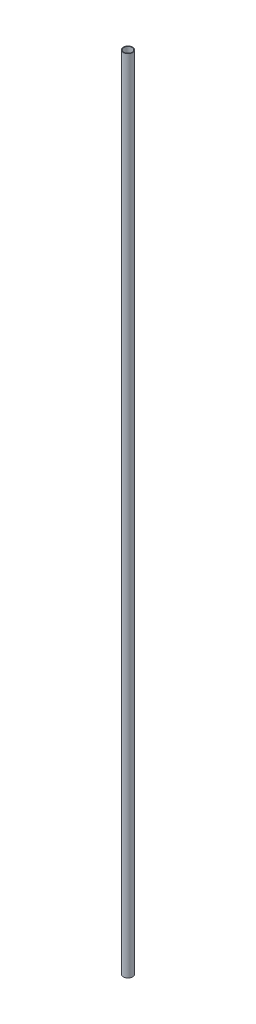
ISO-10303-21;
HEADER;
FILE_DESCRIPTION(('STEP AP214'),'2;1');
FILE_NAME('part.step','',(''),(''),'','','');
FILE_SCHEMA(('AUTOMOTIVE_DESIGN { 1 0 10303 214 1 1 1 1 }'));
ENDSEC;
DATA;
#1=APPLICATION_CONTEXT('core data for automotive mechanical design processes');
#2=APPLICATION_PROTOCOL_DEFINITION('international standard','automotive_design',2000,#1);
#3=PRODUCT_CONTEXT('',#1,'mechanical');
#4=PRODUCT('Part','Part','',(#3));
#5=PRODUCT_RELATED_PRODUCT_CATEGORY('part','',(#4));
#6=PRODUCT_DEFINITION_FORMATION('','',#4);
#7=PRODUCT_DEFINITION_CONTEXT('part definition',#1,'design');
#8=PRODUCT_DEFINITION('design','',#6,#7);
#9=PRODUCT_DEFINITION_SHAPE('','',#8);
#10=(LENGTH_UNIT() NAMED_UNIT(*) SI_UNIT(.MILLI.,.METRE.));
#11=(NAMED_UNIT(*) PLANE_ANGLE_UNIT() SI_UNIT($,.RADIAN.));
#12=(NAMED_UNIT(*) SI_UNIT($,.STERADIAN.) SOLID_ANGLE_UNIT());
#13=UNCERTAINTY_MEASURE_WITH_UNIT(LENGTH_MEASURE(1.E-05),#10,'distance_accuracy_value','');
#14=(GEOMETRIC_REPRESENTATION_CONTEXT(3) GLOBAL_UNCERTAINTY_ASSIGNED_CONTEXT((#13)) GLOBAL_UNIT_ASSIGNED_CONTEXT((#10,
#11,#12)) REPRESENTATION_CONTEXT('',''));
#15=CARTESIAN_POINT('',(0.,0.,0.));
#16=DIRECTION('',(0.,0.,1.));
#17=DIRECTION('',(1.,0.,0.));
#18=AXIS2_PLACEMENT_3D('',#15,#16,#17);
#19=CARTESIAN_POINT('',(0.,125.,0.));
#20=DIRECTION('',(0.,1.,0.));
#21=DIRECTION('',(0.,0.,1.));
#22=AXIS2_PLACEMENT_3D('',#19,#20,#21);
#23=PLANE('',#22);
#24=CARTESIAN_POINT('',(0.,125.,0.));
#25=DIRECTION('',(0.,1.,0.));
#26=DIRECTION('',(0.,0.,1.));
#27=AXIS2_PLACEMENT_3D('',#24,#25,#26);
#28=CIRCLE('',#27,0.73533);
#29=CARTESIAN_POINT('',(0.,125.,0.73533));
#30=VERTEX_POINT('',#29);
#31=EDGE_CURVE('E90',#30,#30,#28,.T.);
#32=ORIENTED_EDGE('',*,*,#31,.T.);
#33=EDGE_LOOP('',(#32));
#34=FACE_BOUND('',#33,.T.);
#35=CARTESIAN_POINT('',(0.,125.,0.));
#36=DIRECTION('',(0.,1.,0.));
#37=DIRECTION('',(0.,0.,1.));
#38=AXIS2_PLACEMENT_3D('',#35,#36,#37);
#39=CIRCLE('',#38,0.64516);
#40=CARTESIAN_POINT('',(0.,125.,0.64516));
#41=VERTEX_POINT('',#40);
#42=EDGE_CURVE('E91',#41,#41,#39,.T.);
#43=ORIENTED_EDGE('',*,*,#42,.F.);
#44=EDGE_LOOP('',(#43));
#45=FACE_BOUND('',#44,.T.);
#46=ADVANCED_FACE('F32',(#34,#45),#23,.T.);
#47=CARTESIAN_POINT('',(0.,0.,0.));
#48=DIRECTION('',(0.,1.,0.));
#49=DIRECTION('',(0.,0.,1.));
#50=AXIS2_PLACEMENT_3D('',#47,#48,#49);
#51=PLANE('',#50);
#52=CARTESIAN_POINT('',(0.,0.,0.));
#53=DIRECTION('',(0.,1.,0.));
#54=DIRECTION('',(0.,0.,1.));
#55=AXIS2_PLACEMENT_3D('',#52,#53,#54);
#56=CIRCLE('',#55,0.64516);
#57=CARTESIAN_POINT('',(-0.5,0.,-0.407714882730567));
#58=VERTEX_POINT('',#57);
#59=CARTESIAN_POINT('',(0.5,0.,-0.407714882730567));
#60=VERTEX_POINT('',#59);
#61=EDGE_CURVE('E77',#58,#60,#56,.T.);
#62=ORIENTED_EDGE('',*,*,#61,.T.);
#63=DIRECTION('',(0.,0.,1.));
#64=VECTOR('',#63,1.);
#65=CARTESIAN_POINT('',(0.5,0.,-0.73533));
#66=LINE('',#65,#64);
#67=CARTESIAN_POINT('',(0.5,0.,-0.539175489891742));
#68=VERTEX_POINT('',#67);
#69=EDGE_CURVE('E74',#68,#60,#66,.T.);
#70=ORIENTED_EDGE('',*,*,#69,.F.);
#71=CARTESIAN_POINT('',(0.,0.,0.));
#72=DIRECTION('',(0.,1.,0.));
#73=DIRECTION('',(0.,0.,1.));
#74=AXIS2_PLACEMENT_3D('',#71,#72,#73);
#75=CIRCLE('',#74,0.73533);
#76=CARTESIAN_POINT('',(-0.5,0.,-0.539175489891742));
#77=VERTEX_POINT('',#76);
#78=EDGE_CURVE('E85',#77,#68,#75,.T.);
#79=ORIENTED_EDGE('',*,*,#78,.F.);
#80=DIRECTION('',(0.,0.,-1.));
#81=VECTOR('',#80,1.);
#82=CARTESIAN_POINT('',(-0.5,0.,-0.73533));
#83=LINE('',#82,#81);
#84=EDGE_CURVE('E87',#58,#77,#83,.T.);
#85=ORIENTED_EDGE('',*,*,#84,.F.);
#86=EDGE_LOOP('',(#62,#70,#79,#85));
#87=FACE_BOUND('',#86,.T.);
#88=ADVANCED_FACE('F83',(#87),#51,.F.);
#89=CARTESIAN_POINT('',(0.,125.,0.));
#90=DIRECTION('',(0.,-1.,0.));
#91=DIRECTION('',(0.,0.,-1.));
#92=AXIS2_PLACEMENT_3D('',#89,#90,#91);
#93=CYLINDRICAL_SURFACE('',#92,0.73533);
#94=ORIENTED_EDGE('',*,*,#78,.T.);
#95=DIRECTION('',(0.,-1.,0.));
#96=VECTOR('',#95,1.);
#97=CARTESIAN_POINT('',(0.5,125.,-0.539175489891742));
#98=LINE('',#97,#96);
#99=CARTESIAN_POINT('',(0.5,9.99999999999999,-0.539175489891742));
#100=VERTEX_POINT('',#99);
#101=EDGE_CURVE('E71',#68,#100,#98,.F.);
#102=ORIENTED_EDGE('',*,*,#101,.T.);
#103=CARTESIAN_POINT('',(0.,9.99999999999999,0.));
#104=DIRECTION('',(0.,-1.,0.));
#105=DIRECTION('',(0.,0.,-1.));
#106=AXIS2_PLACEMENT_3D('',#103,#104,#105);
#107=CIRCLE('',#106,0.73533);
#108=CARTESIAN_POINT('',(-0.5,9.99999999999999,-0.539175489891742));
#109=VERTEX_POINT('',#108);
#110=EDGE_CURVE('E53',#109,#100,#107,.T.);
#111=ORIENTED_EDGE('',*,*,#110,.F.);
#112=DIRECTION('',(0.,-1.,0.));
#113=VECTOR('',#112,1.);
#114=CARTESIAN_POINT('',(-0.5,125.,-0.539175489891742));
#115=LINE('',#114,#113);
#116=EDGE_CURVE('E78',#109,#77,#115,.T.);
#117=ORIENTED_EDGE('',*,*,#116,.T.);
#118=EDGE_LOOP('',(#94,#102,#111,#117));
#119=FACE_BOUND('',#118,.T.);
#120=ORIENTED_EDGE('',*,*,#31,.F.);
#121=EDGE_LOOP('',(#120));
#122=FACE_BOUND('',#121,.T.);
#123=ADVANCED_FACE('F34',(#119,#122),#93,.T.);
#124=CARTESIAN_POINT('',(0.,125.,0.));
#125=DIRECTION('',(0.,-1.,0.));
#126=DIRECTION('',(0.,0.,-1.));
#127=AXIS2_PLACEMENT_3D('',#124,#125,#126);
#128=CYLINDRICAL_SURFACE('',#127,0.64516);
#129=DIRECTION('',(0.,-1.,0.));
#130=VECTOR('',#129,1.);
#131=CARTESIAN_POINT('',(0.5,125.,-0.407714882730567));
#132=LINE('',#131,#130);
#133=CARTESIAN_POINT('',(0.5,9.99999999999999,-0.407714882730567));
#134=VERTEX_POINT('',#133);
#135=EDGE_CURVE('E11',#60,#134,#132,.F.);
#136=ORIENTED_EDGE('',*,*,#135,.F.);
#137=ORIENTED_EDGE('',*,*,#61,.F.);
#138=DIRECTION('',(0.,-1.,0.));
#139=VECTOR('',#138,1.);
#140=CARTESIAN_POINT('',(-0.5,125.,-0.407714882730567));
#141=LINE('',#140,#139);
#142=CARTESIAN_POINT('',(-0.5,9.99999999999999,-0.407714882730567));
#143=VERTEX_POINT('',#142);
#144=EDGE_CURVE('E40',#143,#58,#141,.T.);
#145=ORIENTED_EDGE('',*,*,#144,.F.);
#146=CARTESIAN_POINT('',(0.,9.99999999999999,0.));
#147=DIRECTION('',(0.,-1.,0.));
#148=DIRECTION('',(0.,0.,-1.));
#149=AXIS2_PLACEMENT_3D('',#146,#147,#148);
#150=CIRCLE('',#149,0.64516);
#151=EDGE_CURVE('E94',#143,#134,#150,.T.);
#152=ORIENTED_EDGE('',*,*,#151,.T.);
#153=EDGE_LOOP('',(#136,#137,#145,#152));
#154=FACE_BOUND('',#153,.T.);
#155=ORIENTED_EDGE('',*,*,#42,.T.);
#156=EDGE_LOOP('',(#155));
#157=FACE_BOUND('',#156,.T.);
#158=ADVANCED_FACE('F109',(#154,#157),#128,.F.);
#159=CARTESIAN_POINT('',(0.5,10.,-0.73533));
#160=DIRECTION('',(1.,0.,0.));
#161=DIRECTION('',(0.,0.,-1.));
#162=AXIS2_PLACEMENT_3D('',#159,#160,#161);
#163=PLANE('',#162);
#164=ORIENTED_EDGE('',*,*,#69,.T.);
#165=ORIENTED_EDGE('',*,*,#135,.T.);
#166=DIRECTION('',(0.,0.,1.));
#167=VECTOR('',#166,1.);
#168=CARTESIAN_POINT('',(0.5,10.,-0.73533));
#169=LINE('',#168,#167);
#170=EDGE_CURVE('E47',#100,#134,#169,.T.);
#171=ORIENTED_EDGE('',*,*,#170,.F.);
#172=ORIENTED_EDGE('',*,*,#101,.F.);
#173=EDGE_LOOP('',(#164,#165,#171,#172));
#174=FACE_BOUND('',#173,.T.);
#175=ADVANCED_FACE('F73',(#174),#163,.F.);
#176=CARTESIAN_POINT('',(-0.5,10.,-0.73533));
#177=DIRECTION('',(-1.,0.,0.));
#178=DIRECTION('',(0.,0.,1.));
#179=AXIS2_PLACEMENT_3D('',#176,#177,#178);
#180=PLANE('',#179);
#181=DIRECTION('',(0.,0.,-1.));
#182=VECTOR('',#181,1.);
#183=CARTESIAN_POINT('',(-0.5,10.,-0.73533));
#184=LINE('',#183,#182);
#185=EDGE_CURVE('E106',#143,#109,#184,.T.);
#186=ORIENTED_EDGE('',*,*,#185,.F.);
#187=ORIENTED_EDGE('',*,*,#144,.T.);
#188=ORIENTED_EDGE('',*,*,#84,.T.);
#189=ORIENTED_EDGE('',*,*,#116,.F.);
#190=EDGE_LOOP('',(#186,#187,#188,#189));
#191=FACE_BOUND('',#190,.T.);
#192=ADVANCED_FACE('F104',(#191),#180,.F.);
#193=CARTESIAN_POINT('',(0.,10.,0.));
#194=DIRECTION('',(0.,-1.,0.));
#195=DIRECTION('',(0.,0.,-1.));
#196=AXIS2_PLACEMENT_3D('',#193,#194,#195);
#197=PLANE('',#196);
#198=ORIENTED_EDGE('',*,*,#110,.T.);
#199=ORIENTED_EDGE('',*,*,#170,.T.);
#200=ORIENTED_EDGE('',*,*,#151,.F.);
#201=ORIENTED_EDGE('',*,*,#185,.T.);
#202=EDGE_LOOP('',(#198,#199,#200,#201));
#203=FACE_BOUND('',#202,.T.);
#204=ADVANCED_FACE('F115',(#203),#197,.T.);
#205=CLOSED_SHELL('',(#46,#88,#123,#158,#175,#192,#204));
#206=MANIFOLD_SOLID_BREP('B2',#205);
#207=ADVANCED_BREP_SHAPE_REPRESENTATION('',(#18,#206),#14);
#208=SHAPE_DEFINITION_REPRESENTATION(#9,#207);
ENDSEC;
END-ISO-10303-21;
